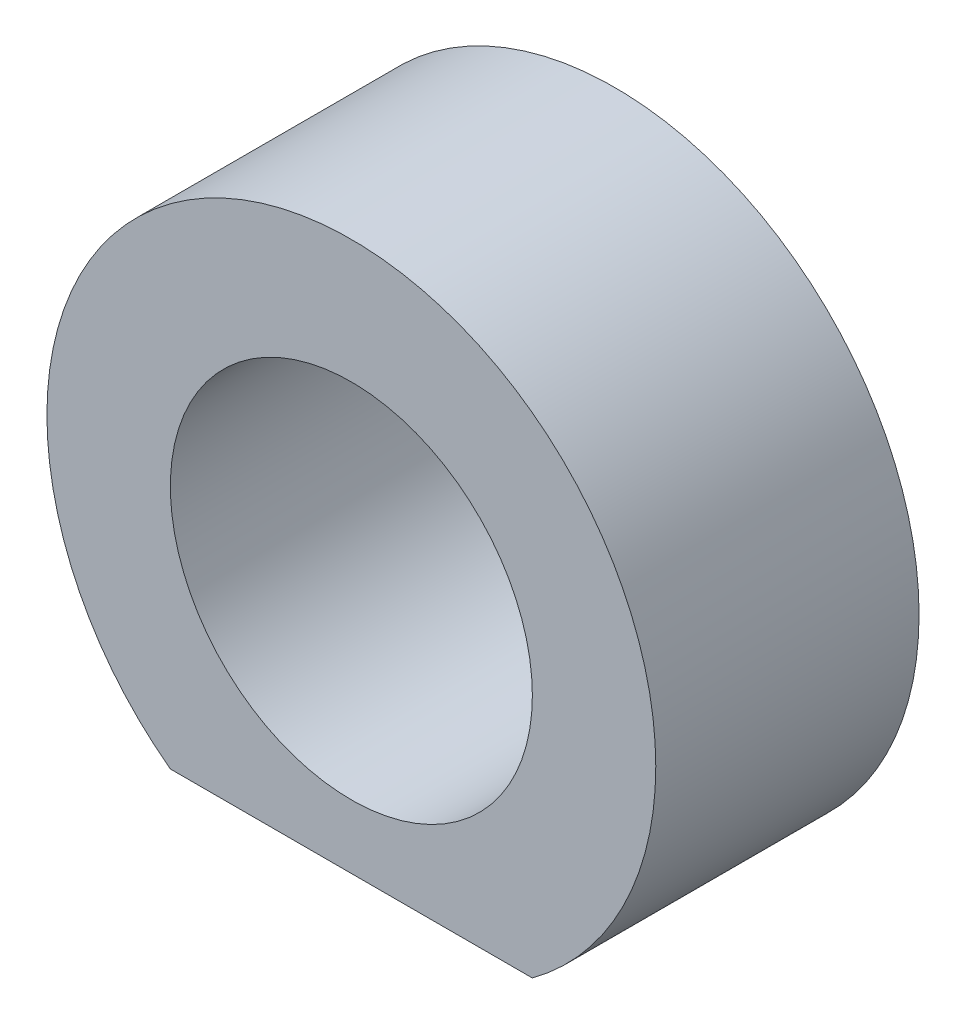
ISO-10303-21;
HEADER;
FILE_DESCRIPTION(('STEP AP214'),'2;1');
FILE_NAME('part.step','',(''),(''),'','','');
FILE_SCHEMA(('AUTOMOTIVE_DESIGN { 1 0 10303 214 1 1 1 1 }'));
ENDSEC;
DATA;
#1=APPLICATION_CONTEXT('core data for automotive mechanical design processes');
#2=APPLICATION_PROTOCOL_DEFINITION('international standard','automotive_design',2000,#1);
#3=PRODUCT_CONTEXT('',#1,'mechanical');
#4=PRODUCT('Part','Part','',(#3));
#5=PRODUCT_RELATED_PRODUCT_CATEGORY('part','',(#4));
#6=PRODUCT_DEFINITION_FORMATION('','',#4);
#7=PRODUCT_DEFINITION_CONTEXT('part definition',#1,'design');
#8=PRODUCT_DEFINITION('design','',#6,#7);
#9=PRODUCT_DEFINITION_SHAPE('','',#8);
#10=(LENGTH_UNIT() NAMED_UNIT(*) SI_UNIT(.MILLI.,.METRE.));
#11=(NAMED_UNIT(*) PLANE_ANGLE_UNIT() SI_UNIT($,.RADIAN.));
#12=(NAMED_UNIT(*) SI_UNIT($,.STERADIAN.) SOLID_ANGLE_UNIT());
#13=UNCERTAINTY_MEASURE_WITH_UNIT(LENGTH_MEASURE(1.E-05),#10,'distance_accuracy_value','');
#14=(GEOMETRIC_REPRESENTATION_CONTEXT(3) GLOBAL_UNCERTAINTY_ASSIGNED_CONTEXT((#13)) GLOBAL_UNIT_ASSIGNED_CONTEXT((#10,
#11,#12)) REPRESENTATION_CONTEXT('',''));
#15=CARTESIAN_POINT('',(0.,0.,0.));
#16=DIRECTION('',(0.,0.,1.));
#17=DIRECTION('',(1.,0.,0.));
#18=AXIS2_PLACEMENT_3D('',#15,#16,#17);
#19=CARTESIAN_POINT('',(0.,0.,8.));
#20=DIRECTION('',(0.,0.,1.));
#21=DIRECTION('',(1.,0.,0.));
#22=AXIS2_PLACEMENT_3D('',#19,#20,#21);
#23=PLANE('',#22);
#24=DIRECTION('',(1.,0.,0.));
#25=VECTOR('',#24,1.);
#26=CARTESIAN_POINT('',(11.,-14.8744747806435,8.));
#27=LINE('',#26,#25);
#28=CARTESIAN_POINT('',(-11.,-14.8744747806435,8.));
#29=VERTEX_POINT('',#28);
#30=CARTESIAN_POINT('',(11.,-14.8744747806435,8.));
#31=VERTEX_POINT('',#30);
#32=EDGE_CURVE('E55',#29,#31,#27,.T.);
#33=ORIENTED_EDGE('',*,*,#32,.T.);
#34=CARTESIAN_POINT('',(0.,0.,8.));
#35=DIRECTION('',(0.,0.,1.));
#36=DIRECTION('',(1.,0.,0.));
#37=AXIS2_PLACEMENT_3D('',#34,#35,#36);
#38=CIRCLE('',#37,18.5);
#39=EDGE_CURVE('E81',#31,#29,#38,.T.);
#40=ORIENTED_EDGE('',*,*,#39,.T.);
#41=EDGE_LOOP('',(#33,#40));
#42=FACE_BOUND('',#41,.T.);
#43=CARTESIAN_POINT('',(0.,0.,8.));
#44=DIRECTION('',(0.,0.,1.));
#45=DIRECTION('',(1.,0.,0.));
#46=AXIS2_PLACEMENT_3D('',#43,#44,#45);
#47=CIRCLE('',#46,11.);
#48=CARTESIAN_POINT('',(11.,0.,8.));
#49=VERTEX_POINT('',#48);
#50=EDGE_CURVE('E82',#49,#49,#47,.T.);
#51=ORIENTED_EDGE('',*,*,#50,.F.);
#52=EDGE_LOOP('',(#51));
#53=FACE_BOUND('',#52,.T.);
#54=ADVANCED_FACE('F39',(#42,#53),#23,.T.);
#55=CARTESIAN_POINT('',(0.,0.,-8.));
#56=DIRECTION('',(0.,0.,1.));
#57=DIRECTION('',(1.,0.,0.));
#58=AXIS2_PLACEMENT_3D('',#55,#56,#57);
#59=PLANE('',#58);
#60=CARTESIAN_POINT('',(0.,0.,-8.));
#61=DIRECTION('',(0.,0.,1.));
#62=DIRECTION('',(1.,0.,0.));
#63=AXIS2_PLACEMENT_3D('',#60,#61,#62);
#64=CIRCLE('',#63,18.5);
#65=CARTESIAN_POINT('',(11.,-14.8744747806435,-8.));
#66=VERTEX_POINT('',#65);
#67=CARTESIAN_POINT('',(-11.,-14.8744747806435,-8.));
#68=VERTEX_POINT('',#67);
#69=EDGE_CURVE('E77',#66,#68,#64,.T.);
#70=ORIENTED_EDGE('',*,*,#69,.F.);
#71=DIRECTION('',(1.,0.,0.));
#72=VECTOR('',#71,1.);
#73=CARTESIAN_POINT('',(11.,-14.8744747806435,-8.));
#74=LINE('',#73,#72);
#75=EDGE_CURVE('E67',#68,#66,#74,.T.);
#76=ORIENTED_EDGE('',*,*,#75,.F.);
#77=EDGE_LOOP('',(#70,#76));
#78=FACE_BOUND('',#77,.T.);
#79=CARTESIAN_POINT('',(0.,0.,-8.));
#80=DIRECTION('',(0.,0.,1.));
#81=DIRECTION('',(1.,0.,0.));
#82=AXIS2_PLACEMENT_3D('',#79,#80,#81);
#83=CIRCLE('',#82,11.);
#84=CARTESIAN_POINT('',(11.,0.,-8.));
#85=VERTEX_POINT('',#84);
#86=EDGE_CURVE('E86',#85,#85,#83,.T.);
#87=ORIENTED_EDGE('',*,*,#86,.T.);
#88=EDGE_LOOP('',(#87));
#89=FACE_BOUND('',#88,.T.);
#90=ADVANCED_FACE('F75',(#78,#89),#59,.F.);
#91=CARTESIAN_POINT('',(0.,0.,8.));
#92=DIRECTION('',(0.,0.,-1.));
#93=DIRECTION('',(-1.,0.,0.));
#94=AXIS2_PLACEMENT_3D('',#91,#92,#93);
#95=CYLINDRICAL_SURFACE('',#94,18.5);
#96=ORIENTED_EDGE('',*,*,#39,.F.);
#97=DIRECTION('',(0.,0.,-1.));
#98=VECTOR('',#97,1.);
#99=CARTESIAN_POINT('',(11.,-14.8744747806435,8.));
#100=LINE('',#99,#98);
#101=EDGE_CURVE('E61',#31,#66,#100,.T.);
#102=ORIENTED_EDGE('',*,*,#101,.T.);
#103=ORIENTED_EDGE('',*,*,#69,.T.);
#104=DIRECTION('',(0.,0.,-1.));
#105=VECTOR('',#104,1.);
#106=CARTESIAN_POINT('',(-11.,-14.8744747806435,8.));
#107=LINE('',#106,#105);
#108=EDGE_CURVE('E64',#29,#68,#107,.T.);
#109=ORIENTED_EDGE('',*,*,#108,.F.);
#110=EDGE_LOOP('',(#96,#102,#103,#109));
#111=FACE_BOUND('',#110,.T.);
#112=ADVANCED_FACE('F80',(#111),#95,.T.);
#113=CARTESIAN_POINT('',(0.,0.,8.));
#114=DIRECTION('',(0.,0.,-1.));
#115=DIRECTION('',(-1.,0.,0.));
#116=AXIS2_PLACEMENT_3D('',#113,#114,#115);
#117=CYLINDRICAL_SURFACE('',#116,11.);
#118=ORIENTED_EDGE('',*,*,#50,.T.);
#119=EDGE_LOOP('',(#118));
#120=FACE_BOUND('',#119,.T.);
#121=ORIENTED_EDGE('',*,*,#86,.F.);
#122=EDGE_LOOP('',(#121));
#123=FACE_BOUND('',#122,.T.);
#124=ADVANCED_FACE('F111',(#120,#123),#117,.F.);
#125=CARTESIAN_POINT('',(11.,-14.8744747806435,8.));
#126=DIRECTION('',(0.,1.,0.));
#127=DIRECTION('',(0.,0.,1.));
#128=AXIS2_PLACEMENT_3D('',#125,#126,#127);
#129=PLANE('',#128);
#130=CARTESIAN_POINT('',(0.,-14.8744747806435,0.));
#131=DIRECTION('',(0.,-1.,0.));
#132=DIRECTION('',(0.,0.,-1.));
#133=AXIS2_PLACEMENT_3D('',#130,#131,#132);
#134=CIRCLE('',#133,1.);
#135=CARTESIAN_POINT('',(0.,-14.8744747806435,-1.));
#136=VERTEX_POINT('',#135);
#137=EDGE_CURVE('E78',#136,#136,#134,.T.);
#138=ORIENTED_EDGE('',*,*,#137,.F.);
#139=EDGE_LOOP('',(#138));
#140=FACE_BOUND('',#139,.T.);
#141=ORIENTED_EDGE('',*,*,#75,.T.);
#142=ORIENTED_EDGE('',*,*,#101,.F.);
#143=ORIENTED_EDGE('',*,*,#32,.F.);
#144=ORIENTED_EDGE('',*,*,#108,.T.);
#145=EDGE_LOOP('',(#141,#142,#143,#144));
#146=FACE_BOUND('',#145,.T.);
#147=ADVANCED_FACE('F66',(#140,#146),#129,.F.);
#148=CARTESIAN_POINT('',(0.,-12.8744747806435,0.));
#149=DIRECTION('',(0.,-1.,0.));
#150=DIRECTION('',(0.,0.,-1.));
#151=AXIS2_PLACEMENT_3D('',#148,#149,#150);
#152=CYLINDRICAL_SURFACE('',#151,1.);
#153=CARTESIAN_POINT('',(0.,-13.1744747806435,0.));
#154=DIRECTION('',(0.,-1.,0.));
#155=DIRECTION('',(0.,0.,-1.));
#156=AXIS2_PLACEMENT_3D('',#153,#154,#155);
#157=CIRCLE('',#156,1.);
#158=CARTESIAN_POINT('',(0.,-13.1744747806435,-1.));
#159=VERTEX_POINT('',#158);
#160=EDGE_CURVE('E11',#159,#159,#157,.F.);
#161=ORIENTED_EDGE('',*,*,#160,.T.);
#162=EDGE_LOOP('',(#161));
#163=FACE_BOUND('',#162,.T.);
#164=ORIENTED_EDGE('',*,*,#137,.T.);
#165=EDGE_LOOP('',(#164));
#166=FACE_BOUND('',#165,.T.);
#167=ADVANCED_FACE('F99',(#163,#166),#152,.F.);
#168=CARTESIAN_POINT('',(0.,-12.8744747806435,0.));
#169=DIRECTION('',(0.,-1.,0.));
#170=DIRECTION('',(0.,0.,-1.));
#171=AXIS2_PLACEMENT_3D('',#168,#169,#170);
#172=PLANE('',#171);
#173=CARTESIAN_POINT('',(0.,-12.8744747806435,0.));
#174=DIRECTION('',(0.,-1.,0.));
#175=DIRECTION('',(0.,0.,-1.));
#176=AXIS2_PLACEMENT_3D('',#173,#174,#175);
#177=CIRCLE('',#176,0.700000000000006);
#178=CARTESIAN_POINT('',(0.,-12.8744747806435,-0.700000000000008));
#179=VERTEX_POINT('',#178);
#180=EDGE_CURVE('E48',#179,#179,#177,.T.);
#181=ORIENTED_EDGE('',*,*,#180,.T.);
#182=EDGE_LOOP('',(#181));
#183=FACE_BOUND('',#182,.T.);
#184=ADVANCED_FACE('F92',(#183),#172,.T.);
#185=CARTESIAN_POINT('',(0.,-12.8744747806435,0.));
#186=DIRECTION('',(0.,-1.,0.));
#187=DIRECTION('',(0.,0.,-1.));
#188=AXIS2_PLACEMENT_3D('',#185,#186,#187);
#189=CONICAL_SURFACE('',#188,0.700000000000006,0.785398163397435);
#190=ORIENTED_EDGE('',*,*,#160,.F.);
#191=EDGE_LOOP('',(#190));
#192=FACE_BOUND('',#191,.T.);
#193=ORIENTED_EDGE('',*,*,#180,.F.);
#194=EDGE_LOOP('',(#193));
#195=FACE_BOUND('',#194,.T.);
#196=ADVANCED_FACE('F42',(#192,#195),#189,.F.);
#197=CLOSED_SHELL('',(#54,#90,#112,#124,#147,#167,#184,#196));
#198=MANIFOLD_SOLID_BREP('B2',#197);
#199=ADVANCED_BREP_SHAPE_REPRESENTATION('',(#18,#198),#14);
#200=SHAPE_DEFINITION_REPRESENTATION(#9,#199);
ENDSEC;
END-ISO-10303-21;
